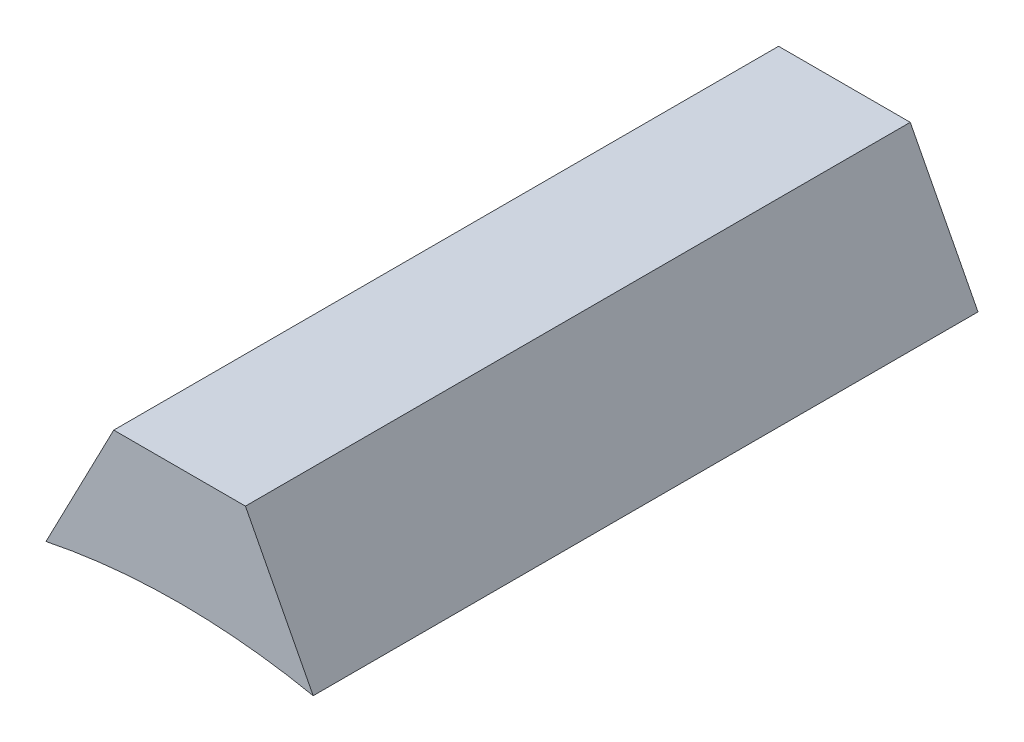
ISO-10303-21;
HEADER;
FILE_DESCRIPTION(('STEP AP214'),'2;1');
FILE_NAME('part.step','',(''),(''),'','','');
FILE_SCHEMA(('AUTOMOTIVE_DESIGN { 1 0 10303 214 1 1 1 1 }'));
ENDSEC;
DATA;
#1=APPLICATION_CONTEXT('core data for automotive mechanical design processes');
#2=APPLICATION_PROTOCOL_DEFINITION('international standard','automotive_design',2000,#1);
#3=PRODUCT_CONTEXT('',#1,'mechanical');
#4=PRODUCT('Part','Part','',(#3));
#5=PRODUCT_RELATED_PRODUCT_CATEGORY('part','',(#4));
#6=PRODUCT_DEFINITION_FORMATION('','',#4);
#7=PRODUCT_DEFINITION_CONTEXT('part definition',#1,'design');
#8=PRODUCT_DEFINITION('design','',#6,#7);
#9=PRODUCT_DEFINITION_SHAPE('','',#8);
#10=(LENGTH_UNIT() NAMED_UNIT(*) SI_UNIT(.MILLI.,.METRE.));
#11=(NAMED_UNIT(*) PLANE_ANGLE_UNIT() SI_UNIT($,.RADIAN.));
#12=(NAMED_UNIT(*) SI_UNIT($,.STERADIAN.) SOLID_ANGLE_UNIT());
#13=UNCERTAINTY_MEASURE_WITH_UNIT(LENGTH_MEASURE(1.E-05),#10,'distance_accuracy_value','');
#14=(GEOMETRIC_REPRESENTATION_CONTEXT(3) GLOBAL_UNCERTAINTY_ASSIGNED_CONTEXT((#13)) GLOBAL_UNIT_ASSIGNED_CONTEXT((#10,
#11,#12)) REPRESENTATION_CONTEXT('',''));
#15=CARTESIAN_POINT('',(0.,0.,0.));
#16=DIRECTION('',(0.,0.,1.));
#17=DIRECTION('',(1.,0.,0.));
#18=AXIS2_PLACEMENT_3D('',#15,#16,#17);
#19=CARTESIAN_POINT('',(0.,0.,10.));
#20=DIRECTION('',(0.,0.,-1.));
#21=DIRECTION('',(-1.,0.,0.));
#22=AXIS2_PLACEMENT_3D('',#19,#20,#21);
#23=CYLINDRICAL_SURFACE('',#22,10.);
#24=CARTESIAN_POINT('',(0.,0.,0.));
#25=DIRECTION('',(0.,0.,1.));
#26=DIRECTION('',(1.,0.,0.));
#27=AXIS2_PLACEMENT_3D('',#24,#25,#26);
#28=CIRCLE('',#27,10.);
#29=CARTESIAN_POINT('',(2.00957818935764,9.79599895369829,0.));
#30=VERTEX_POINT('',#29);
#31=CARTESIAN_POINT('',(-2.00957818935764,9.79599895369829,0.));
#32=VERTEX_POINT('',#31);
#33=EDGE_CURVE('E101',#30,#32,#28,.T.);
#34=ORIENTED_EDGE('',*,*,#33,.F.);
#35=DIRECTION('',(0.,0.,-1.));
#36=VECTOR('',#35,1.);
#37=CARTESIAN_POINT('',(2.00957818935764,9.79599895369829,10.));
#38=LINE('',#37,#36);
#39=CARTESIAN_POINT('',(2.00957818935764,9.79599895369829,10.));
#40=VERTEX_POINT('',#39);
#41=EDGE_CURVE('E11',#40,#30,#38,.T.);
#42=ORIENTED_EDGE('',*,*,#41,.F.);
#43=CARTESIAN_POINT('',(0.,0.,10.));
#44=DIRECTION('',(0.,0.,1.));
#45=DIRECTION('',(1.,0.,0.));
#46=AXIS2_PLACEMENT_3D('',#43,#44,#45);
#47=CIRCLE('',#46,10.);
#48=CARTESIAN_POINT('',(-2.00957818935764,9.79599895369829,10.));
#49=VERTEX_POINT('',#48);
#50=EDGE_CURVE('E94',#40,#49,#47,.T.);
#51=ORIENTED_EDGE('',*,*,#50,.T.);
#52=DIRECTION('',(0.,0.,-1.));
#53=VECTOR('',#52,1.);
#54=CARTESIAN_POINT('',(-2.00957818935764,9.79599895369829,10.));
#55=LINE('',#54,#53);
#56=EDGE_CURVE('E76',#49,#32,#55,.T.);
#57=ORIENTED_EDGE('',*,*,#56,.T.);
#58=EDGE_LOOP('',(#34,#42,#51,#57));
#59=FACE_BOUND('',#58,.T.);
#60=ADVANCED_FACE('F38',(#59),#23,.F.);
#61=CARTESIAN_POINT('',(5.59104595218085,2.90645534301338,10.));
#62=DIRECTION('',(0.887274512216637,0.461241737021628,0.));
#63=DIRECTION('',(-0.461241737021628,0.887274512216637,0.));
#64=AXIS2_PLACEMENT_3D('',#61,#62,#63);
#65=PLANE('',#64);
#66=DIRECTION('',(0.461241737021628,-0.887274512216637,0.));
#67=VECTOR('',#66,1.);
#68=CARTESIAN_POINT('',(5.59104595218085,2.90645534301338,0.));
#69=LINE('',#68,#67);
#70=CARTESIAN_POINT('',(0.990394049488707,11.7565676489782,0.));
#71=VERTEX_POINT('',#70);
#72=EDGE_CURVE('E87',#71,#30,#69,.T.);
#73=ORIENTED_EDGE('',*,*,#72,.F.);
#74=DIRECTION('',(0.,0.,-1.));
#75=VECTOR('',#74,1.);
#76=CARTESIAN_POINT('',(0.990394049488707,11.7565676489782,10.));
#77=LINE('',#76,#75);
#78=CARTESIAN_POINT('',(0.990394049488707,11.7565676489782,10.));
#79=VERTEX_POINT('',#78);
#80=EDGE_CURVE('E46',#79,#71,#77,.T.);
#81=ORIENTED_EDGE('',*,*,#80,.F.);
#82=DIRECTION('',(0.461241737021628,-0.887274512216637,0.));
#83=VECTOR('',#82,1.);
#84=CARTESIAN_POINT('',(5.59104595218085,2.90645534301338,10.));
#85=LINE('',#84,#83);
#86=EDGE_CURVE('E85',#79,#40,#85,.T.);
#87=ORIENTED_EDGE('',*,*,#86,.T.);
#88=ORIENTED_EDGE('',*,*,#41,.T.);
#89=EDGE_LOOP('',(#73,#81,#87,#88));
#90=FACE_BOUND('',#89,.T.);
#91=ADVANCED_FACE('F84',(#90),#65,.T.);
#92=CARTESIAN_POINT('',(0.,11.7565676489782,10.));
#93=DIRECTION('',(0.,1.,0.));
#94=DIRECTION('',(0.,0.,1.));
#95=AXIS2_PLACEMENT_3D('',#92,#93,#94);
#96=PLANE('',#95);
#97=DIRECTION('',(1.,0.,0.));
#98=VECTOR('',#97,1.);
#99=CARTESIAN_POINT('',(0.,11.7565676489782,0.));
#100=LINE('',#99,#98);
#101=CARTESIAN_POINT('',(-0.990394049488707,11.7565676489782,0.));
#102=VERTEX_POINT('',#101);
#103=EDGE_CURVE('E105',#102,#71,#100,.T.);
#104=ORIENTED_EDGE('',*,*,#103,.F.);
#105=DIRECTION('',(0.,0.,-1.));
#106=VECTOR('',#105,1.);
#107=CARTESIAN_POINT('',(-0.990394049488707,11.7565676489782,10.));
#108=LINE('',#107,#106);
#109=CARTESIAN_POINT('',(-0.990394049488707,11.7565676489782,10.));
#110=VERTEX_POINT('',#109);
#111=EDGE_CURVE('E69',#110,#102,#108,.T.);
#112=ORIENTED_EDGE('',*,*,#111,.F.);
#113=DIRECTION('',(1.,0.,0.));
#114=VECTOR('',#113,1.);
#115=CARTESIAN_POINT('',(0.,11.7565676489782,10.));
#116=LINE('',#115,#114);
#117=EDGE_CURVE('E93',#110,#79,#116,.T.);
#118=ORIENTED_EDGE('',*,*,#117,.T.);
#119=ORIENTED_EDGE('',*,*,#80,.T.);
#120=EDGE_LOOP('',(#104,#112,#118,#119));
#121=FACE_BOUND('',#120,.T.);
#122=ADVANCED_FACE('F96',(#121),#96,.T.);
#123=CARTESIAN_POINT('',(-5.59104595218085,2.90645534301338,10.));
#124=DIRECTION('',(0.887274512216637,-0.461241737021628,0.));
#125=DIRECTION('',(0.461241737021628,0.887274512216637,0.));
#126=AXIS2_PLACEMENT_3D('',#123,#124,#125);
#127=PLANE('',#126);
#128=DIRECTION('',(-0.461241737021628,-0.887274512216637,0.));
#129=VECTOR('',#128,1.);
#130=CARTESIAN_POINT('',(-5.59104595218085,2.90645534301338,0.));
#131=LINE('',#130,#129);
#132=EDGE_CURVE('E107',#102,#32,#131,.T.);
#133=ORIENTED_EDGE('',*,*,#132,.T.);
#134=ORIENTED_EDGE('',*,*,#56,.F.);
#135=DIRECTION('',(-0.461241737021628,-0.887274512216637,0.));
#136=VECTOR('',#135,1.);
#137=CARTESIAN_POINT('',(-5.59104595218085,2.90645534301338,10.));
#138=LINE('',#137,#136);
#139=EDGE_CURVE('E54',#110,#49,#138,.T.);
#140=ORIENTED_EDGE('',*,*,#139,.F.);
#141=ORIENTED_EDGE('',*,*,#111,.T.);
#142=EDGE_LOOP('',(#133,#134,#140,#141));
#143=FACE_BOUND('',#142,.T.);
#144=ADVANCED_FACE('F117',(#143),#127,.F.);
#145=CARTESIAN_POINT('',(0.,0.,10.));
#146=DIRECTION('',(0.,0.,1.));
#147=DIRECTION('',(1.,0.,0.));
#148=AXIS2_PLACEMENT_3D('',#145,#146,#147);
#149=PLANE('',#148);
#150=ORIENTED_EDGE('',*,*,#50,.F.);
#151=ORIENTED_EDGE('',*,*,#86,.F.);
#152=ORIENTED_EDGE('',*,*,#117,.F.);
#153=ORIENTED_EDGE('',*,*,#139,.T.);
#154=EDGE_LOOP('',(#150,#151,#152,#153));
#155=FACE_BOUND('',#154,.T.);
#156=ADVANCED_FACE('F92',(#155),#149,.T.);
#157=CARTESIAN_POINT('',(0.,0.,0.));
#158=DIRECTION('',(0.,0.,1.));
#159=DIRECTION('',(1.,0.,0.));
#160=AXIS2_PLACEMENT_3D('',#157,#158,#159);
#161=PLANE('',#160);
#162=ORIENTED_EDGE('',*,*,#33,.T.);
#163=ORIENTED_EDGE('',*,*,#132,.F.);
#164=ORIENTED_EDGE('',*,*,#103,.T.);
#165=ORIENTED_EDGE('',*,*,#72,.T.);
#166=EDGE_LOOP('',(#162,#163,#164,#165));
#167=FACE_BOUND('',#166,.T.);
#168=ADVANCED_FACE('F122',(#167),#161,.F.);
#169=CLOSED_SHELL('',(#60,#91,#122,#144,#156,#168));
#170=MANIFOLD_SOLID_BREP('B2',#169);
#171=ADVANCED_BREP_SHAPE_REPRESENTATION('',(#18,#170),#14);
#172=SHAPE_DEFINITION_REPRESENTATION(#9,#171);
ENDSEC;
END-ISO-10303-21;
